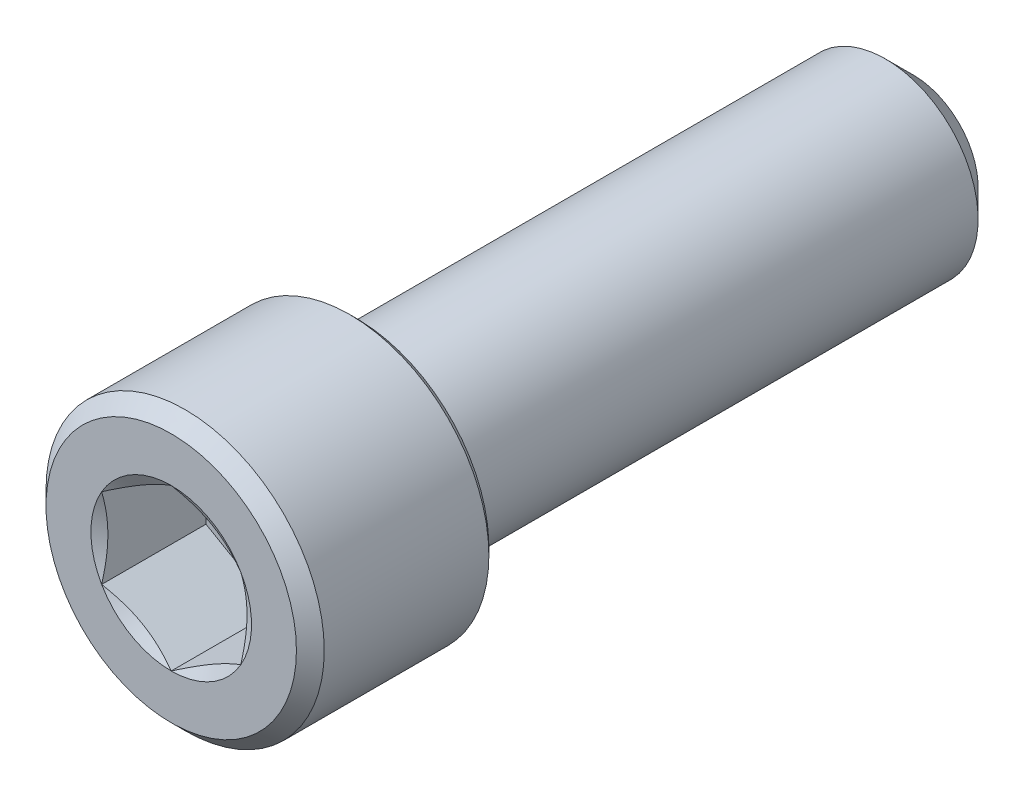
ISO-10303-21;
HEADER;
FILE_DESCRIPTION(('STEP AP214'),'2;1');
FILE_NAME('part.step','',(''),(''),'','','');
FILE_SCHEMA(('AUTOMOTIVE_DESIGN { 1 0 10303 214 1 1 1 1 }'));
ENDSEC;
DATA;
#1=APPLICATION_CONTEXT('core data for automotive mechanical design processes');
#2=APPLICATION_PROTOCOL_DEFINITION('international standard','automotive_design',2000,#1);
#3=PRODUCT_CONTEXT('',#1,'mechanical');
#4=PRODUCT('Part','Part','',(#3));
#5=PRODUCT_RELATED_PRODUCT_CATEGORY('part','',(#4));
#6=PRODUCT_DEFINITION_FORMATION('','',#4);
#7=PRODUCT_DEFINITION_CONTEXT('part definition',#1,'design');
#8=PRODUCT_DEFINITION('design','',#6,#7);
#9=PRODUCT_DEFINITION_SHAPE('','',#8);
#10=(LENGTH_UNIT() NAMED_UNIT(*) SI_UNIT(.MILLI.,.METRE.));
#11=(NAMED_UNIT(*) PLANE_ANGLE_UNIT() SI_UNIT($,.RADIAN.));
#12=(NAMED_UNIT(*) SI_UNIT($,.STERADIAN.) SOLID_ANGLE_UNIT());
#13=UNCERTAINTY_MEASURE_WITH_UNIT(LENGTH_MEASURE(1.E-05),#10,'distance_accuracy_value','');
#14=(GEOMETRIC_REPRESENTATION_CONTEXT(3) GLOBAL_UNCERTAINTY_ASSIGNED_CONTEXT((#13)) GLOBAL_UNIT_ASSIGNED_CONTEXT((#10,
#11,#12)) REPRESENTATION_CONTEXT('',''));
#15=CARTESIAN_POINT('',(0.,0.,0.));
#16=DIRECTION('',(0.,0.,1.));
#17=DIRECTION('',(1.,0.,0.));
#18=AXIS2_PLACEMENT_3D('',#15,#16,#17);
#19=CARTESIAN_POINT('',(0.,4.7625,12.7));
#20=DIRECTION('',(0.,0.,1.));
#21=DIRECTION('',(1.,0.,0.));
#22=AXIS2_PLACEMENT_3D('',#19,#20,#21);
#23=PLANE('',#22);
#24=CARTESIAN_POINT('',(0.,0.,12.7));
#25=DIRECTION('',(0.,0.,1.));
#26=DIRECTION('',(1.,0.,0.));
#27=AXIS2_PLACEMENT_3D('',#24,#25,#26);
#28=CIRCLE('',#27,4.28625);
#29=CARTESIAN_POINT('',(4.28625,0.,12.7));
#30=VERTEX_POINT('',#29);
#31=EDGE_CURVE('E169',#30,#30,#28,.T.);
#32=ORIENTED_EDGE('',*,*,#31,.T.);
#33=EDGE_LOOP('',(#32));
#34=FACE_BOUND('',#33,.T.);
#35=CARTESIAN_POINT('',(0.,0.,12.7));
#36=DIRECTION('',(0.,0.,1.));
#37=DIRECTION('',(1.,0.,0.));
#38=AXIS2_PLACEMENT_3D('',#35,#36,#37);
#39=CIRCLE('',#38,2.74963065701559);
#40=CARTESIAN_POINT('',(2.38125,1.3748153285078,12.7));
#41=VERTEX_POINT('',#40);
#42=CARTESIAN_POINT('',(0.,2.74963065701559,12.7));
#43=VERTEX_POINT('',#42);
#44=EDGE_CURVE('E87',#41,#43,#39,.T.);
#45=ORIENTED_EDGE('',*,*,#44,.F.);
#46=CARTESIAN_POINT('',(2.38125,-1.3748153285078,12.7));
#47=VERTEX_POINT('',#46);
#48=EDGE_CURVE('E47',#47,#41,#39,.T.);
#49=ORIENTED_EDGE('',*,*,#48,.F.);
#50=CARTESIAN_POINT('',(0.,-2.7496306570156,12.7));
#51=VERTEX_POINT('',#50);
#52=EDGE_CURVE('E274',#51,#47,#39,.T.);
#53=ORIENTED_EDGE('',*,*,#52,.F.);
#54=CARTESIAN_POINT('',(-2.38125,-1.3748153285078,12.7));
#55=VERTEX_POINT('',#54);
#56=EDGE_CURVE('E54',#55,#51,#39,.T.);
#57=ORIENTED_EDGE('',*,*,#56,.F.);
#58=CARTESIAN_POINT('',(-2.38125,1.3748153285078,12.7));
#59=VERTEX_POINT('',#58);
#60=EDGE_CURVE('E127',#59,#55,#39,.T.);
#61=ORIENTED_EDGE('',*,*,#60,.F.);
#62=EDGE_CURVE('E96',#43,#59,#39,.T.);
#63=ORIENTED_EDGE('',*,*,#62,.F.);
#64=EDGE_LOOP('',(#45,#49,#53,#57,#61,#63));
#65=FACE_BOUND('',#64,.T.);
#66=ADVANCED_FACE('F33',(#34,#65),#23,.T.);
#67=CARTESIAN_POINT('',(0.,0.,-12.7));
#68=DIRECTION('',(0.,0.,-1.));
#69=DIRECTION('',(-1.,0.,0.));
#70=AXIS2_PLACEMENT_3D('',#67,#68,#69);
#71=CYLINDRICAL_SURFACE('',#70,4.7625);
#72=CARTESIAN_POINT('',(0.,0.,6.58812499999999));
#73=DIRECTION('',(0.,0.,-1.));
#74=DIRECTION('',(-1.,0.,0.));
#75=AXIS2_PLACEMENT_3D('',#72,#73,#74);
#76=CIRCLE('',#75,4.7625);
#77=CARTESIAN_POINT('',(-4.7625,0.,6.58812499999999));
#78=VERTEX_POINT('',#77);
#79=EDGE_CURVE('E11',#78,#78,#76,.F.);
#80=ORIENTED_EDGE('',*,*,#79,.T.);
#81=EDGE_LOOP('',(#80));
#82=FACE_BOUND('',#81,.T.);
#83=CARTESIAN_POINT('',(0.,0.,12.22375));
#84=DIRECTION('',(0.,0.,1.));
#85=DIRECTION('',(1.,0.,0.));
#86=AXIS2_PLACEMENT_3D('',#83,#84,#85);
#87=CIRCLE('',#86,4.7625);
#88=CARTESIAN_POINT('',(4.7625,0.,12.22375));
#89=VERTEX_POINT('',#88);
#90=EDGE_CURVE('E106',#89,#89,#87,.F.);
#91=ORIENTED_EDGE('',*,*,#90,.T.);
#92=EDGE_LOOP('',(#91));
#93=FACE_BOUND('',#92,.T.);
#94=ADVANCED_FACE('F186',(#82,#93),#71,.T.);
#95=CARTESIAN_POINT('',(0.,4.7625,6.35));
#96=DIRECTION('',(0.,0.,-1.));
#97=DIRECTION('',(-1.,0.,0.));
#98=AXIS2_PLACEMENT_3D('',#95,#96,#97);
#99=PLANE('',#98);
#100=CARTESIAN_POINT('',(0.,0.,6.35));
#101=DIRECTION('',(0.,0.,-1.));
#102=DIRECTION('',(-1.,0.,0.));
#103=AXIS2_PLACEMENT_3D('',#100,#101,#102);
#104=CIRCLE('',#103,4.52437500000001);
#105=CARTESIAN_POINT('',(-4.52437500000001,0.,6.35));
#106=VERTEX_POINT('',#105);
#107=EDGE_CURVE('E41',#106,#106,#104,.T.);
#108=ORIENTED_EDGE('',*,*,#107,.T.);
#109=EDGE_LOOP('',(#108));
#110=FACE_BOUND('',#109,.T.);
#111=CARTESIAN_POINT('',(0.,0.,6.35));
#112=DIRECTION('',(0.,0.,-1.));
#113=DIRECTION('',(-1.,0.,0.));
#114=AXIS2_PLACEMENT_3D('',#111,#112,#113);
#115=CIRCLE('',#114,3.175);
#116=CARTESIAN_POINT('',(-3.175,0.,6.35));
#117=VERTEX_POINT('',#116);
#118=EDGE_CURVE('E107',#117,#117,#115,.T.);
#119=ORIENTED_EDGE('',*,*,#118,.F.);
#120=EDGE_LOOP('',(#119));
#121=FACE_BOUND('',#120,.T.);
#122=ADVANCED_FACE('F174',(#110,#121),#99,.T.);
#123=CARTESIAN_POINT('',(0.,0.,-12.7));
#124=DIRECTION('',(0.,0.,-1.));
#125=DIRECTION('',(-1.,0.,0.));
#126=AXIS2_PLACEMENT_3D('',#123,#124,#125);
#127=CYLINDRICAL_SURFACE('',#126,3.175);
#128=ORIENTED_EDGE('',*,*,#118,.T.);
#129=EDGE_LOOP('',(#128));
#130=FACE_BOUND('',#129,.T.);
#131=CARTESIAN_POINT('',(0.,0.,-11.7475));
#132=DIRECTION('',(0.,0.,-1.));
#133=DIRECTION('',(-1.,0.,0.));
#134=AXIS2_PLACEMENT_3D('',#131,#132,#133);
#135=CIRCLE('',#134,3.175);
#136=CARTESIAN_POINT('',(-3.175,0.,-11.7475));
#137=VERTEX_POINT('',#136);
#138=EDGE_CURVE('E215',#137,#137,#135,.T.);
#139=ORIENTED_EDGE('',*,*,#138,.F.);
#140=EDGE_LOOP('',(#139));
#141=FACE_BOUND('',#140,.T.);
#142=ADVANCED_FACE('F197',(#130,#141),#127,.T.);
#143=CARTESIAN_POINT('',(0.,0.,-12.7));
#144=DIRECTION('',(0.,0.,1.));
#145=DIRECTION('',(1.,0.,0.));
#146=AXIS2_PLACEMENT_3D('',#143,#144,#145);
#147=CONICAL_SURFACE('',#146,2.2225,0.785398163397441);
#148=ORIENTED_EDGE('',*,*,#138,.T.);
#149=EDGE_LOOP('',(#148));
#150=FACE_BOUND('',#149,.T.);
#151=CARTESIAN_POINT('',(0.,0.,-12.7));
#152=DIRECTION('',(0.,0.,-1.));
#153=DIRECTION('',(-1.,0.,0.));
#154=AXIS2_PLACEMENT_3D('',#151,#152,#153);
#155=CIRCLE('',#154,2.2225);
#156=CARTESIAN_POINT('',(-2.2225,0.,-12.7));
#157=VERTEX_POINT('',#156);
#158=EDGE_CURVE('E213',#157,#157,#155,.T.);
#159=ORIENTED_EDGE('',*,*,#158,.F.);
#160=EDGE_LOOP('',(#159));
#161=FACE_BOUND('',#160,.T.);
#162=ADVANCED_FACE('F200',(#150,#161),#147,.T.);
#163=CARTESIAN_POINT('',(0.,2.2225,-12.7));
#164=DIRECTION('',(0.,0.,-1.));
#165=DIRECTION('',(-1.,0.,0.));
#166=AXIS2_PLACEMENT_3D('',#163,#164,#165);
#167=PLANE('',#166);
#168=ORIENTED_EDGE('',*,*,#158,.T.);
#169=EDGE_LOOP('',(#168));
#170=FACE_BOUND('',#169,.T.);
#171=ADVANCED_FACE('F203',(#170),#167,.T.);
#172=CARTESIAN_POINT('',(0.,0.,12.7));
#173=DIRECTION('',(0.,0.,1.));
#174=DIRECTION('',(1.,0.,0.));
#175=AXIS2_PLACEMENT_3D('',#172,#173,#174);
#176=CONICAL_SURFACE('',#175,2.74963065701559,1.0471975511966);
#177=ORIENTED_EDGE('',*,*,#62,.T.);
#178=CARTESIAN_POINT('',(0.000199999999999313,2.74974612706943,12.700066670866));
#179=CARTESIAN_POINT('',(-0.104444891421977,2.68932937083763,12.6651705786252));
#180=CARTESIAN_POINT('',(-0.209993068604497,2.62839110232883,12.6334335727749));
#181=CARTESIAN_POINT('',(-0.422917194172112,2.5054593011154,12.5780356628231));
#182=CARTESIAN_POINT('',(-0.53029692661342,2.4434635836849,12.5543943575836));
#183=CARTESIAN_POINT('',(-0.743725586936215,2.32024048919476,12.5175923353969));
#184=CARTESIAN_POINT('',(-0.849741671537568,2.25903207421173,12.504186696564));
#185=CARTESIAN_POINT('',(-1.06227281790212,2.13632715964698,12.4881816145045));
#186=CARTESIAN_POINT('',(-1.16878710689782,2.07483110622277,12.4855689193147));
#187=CARTESIAN_POINT('',(-1.36782399030973,1.95991710800624,12.4909970804572));
#188=CARTESIAN_POINT('',(-1.46037634256186,1.90648198251934,12.4977051369489));
#189=CARTESIAN_POINT('',(-1.64487805384685,1.79995986984301,12.518967960713));
#190=CARTESIAN_POINT('',(-1.73682677447075,1.74687325123916,12.5335299951235));
#191=CARTESIAN_POINT('',(-1.92170905711006,1.64013141558896,12.5699348288166));
#192=CARTESIAN_POINT('',(-2.01461921296538,1.58648971209544,12.5919319849727));
#193=CARTESIAN_POINT('',(-2.19905359425544,1.4800064724098,12.6418572147018));
#194=CARTESIAN_POINT('',(-2.29058018354621,1.42716357144477,12.6697735535082));
#195=CARTESIAN_POINT('',(-2.38145,1.37469985845396,12.700066670866));
#196=B_SPLINE_CURVE_WITH_KNOTS('',3,(#178,#179,#180,#181,#182,#183,#184,#185,#186,#187,#188,
#189,#190,#191,#192,#193,#194,#195),.UNSPECIFIED.,.F.,.F.,(4,2,2,2,2,2,2,2,4),(0.,
0.377463001720441,0.755833447356087,1.1248388545394,1.49339104874267,1.81432726847354,
2.1355609551887,2.46392121913821,2.79163649648301),.UNSPECIFIED.);
#197=EDGE_CURVE('E101',#43,#59,#196,.T.);
#198=ORIENTED_EDGE('',*,*,#197,.F.);
#199=EDGE_LOOP('',(#177,#198));
#200=FACE_BOUND('',#199,.T.);
#201=ADVANCED_FACE('F102',(#200),#176,.F.);
#202=ORIENTED_EDGE('',*,*,#60,.T.);
#203=CARTESIAN_POINT('',(-2.38125,-3.56031432041408,13.5854327813108));
#204=CARTESIAN_POINT('',(-2.38125,-3.45748374459471,13.5360985621719));
#205=CARTESIAN_POINT('',(-2.38125,-3.35440265943941,13.4872767676642));
#206=CARTESIAN_POINT('',(-2.38125,-3.14760595557445,13.3909487177979));
#207=CARTESIAN_POINT('',(-2.38125,-3.04389022671774,13.3434426991917));
#208=CARTESIAN_POINT('',(-2.38125,-2.83509604479696,13.2497714977183));
#209=CARTESIAN_POINT('',(-2.38125,-2.73001314180502,13.2036161964771));
#210=CARTESIAN_POINT('',(-2.38125,-2.5189655488985,13.1133753131819));
#211=CARTESIAN_POINT('',(-2.38125,-2.41300090517103,13.0692896235117));
#212=CARTESIAN_POINT('',(-2.38125,-2.19722997657368,12.9826164755131));
#213=CARTESIAN_POINT('',(-2.38125,-2.08739568642801,12.9400983262348));
#214=CARTESIAN_POINT('',(-2.38125,-1.86639857650948,12.8585970218555));
#215=CARTESIAN_POINT('',(-2.38125,-1.75523560433475,12.8196142767613));
#216=CARTESIAN_POINT('',(-2.38125,-1.53166103833463,12.7462985594297));
#217=CARTESIAN_POINT('',(-2.38125,-1.41925300915091,12.7119548339663));
#218=CARTESIAN_POINT('',(-2.38125,-1.19282596671567,12.6490916591874));
#219=CARTESIAN_POINT('',(-2.38125,-1.07880736110514,12.620570763371));
#220=CARTESIAN_POINT('',(-2.38125,-0.849396676134234,12.5708736258817));
#221=CARTESIAN_POINT('',(-2.38125,-0.734007929376447,12.54968229925));
#222=CARTESIAN_POINT('',(-2.38125,-0.501939482389592,12.5160319446491));
#223=CARTESIAN_POINT('',(-2.38125,-0.385259869941057,12.503572326575));
#224=CARTESIAN_POINT('',(-2.38125,-0.152653744375681,12.4885413975669));
#225=CARTESIAN_POINT('',(-2.38125,-0.036734958225554,12.4858533979373));
#226=CARTESIAN_POINT('',(-2.38125,0.194921420761422,12.4902935875384));
#227=CARTESIAN_POINT('',(-2.38125,0.310659001934529,12.4974223845882));
#228=CARTESIAN_POINT('',(-2.38125,0.511064358227531,12.5177854394961));
#229=CARTESIAN_POINT('',(-2.38125,0.595953717526414,12.5289393879405));
#230=CARTESIAN_POINT('',(-2.38125,0.765022556422734,12.555761218176));
#231=CARTESIAN_POINT('',(-2.38125,0.849201910592195,12.5714298810206));
#232=CARTESIAN_POINT('',(-2.38125,1.10063158151713,12.6243792501024));
#233=CARTESIAN_POINT('',(-2.38125,1.26664254896707,12.6675883896334));
#234=CARTESIAN_POINT('',(-2.38125,1.51487878922651,12.7414090899076));
#235=CARTESIAN_POINT('',(-2.38125,1.59841261020007,12.7678615121722));
#236=CARTESIAN_POINT('',(-2.38125,1.76461552147617,12.8232125840672));
#237=CARTESIAN_POINT('',(-2.38125,1.8472851157426,12.8521097070595));
#238=CARTESIAN_POINT('',(-2.38125,2.0118638893944,12.9119314662197));
#239=CARTESIAN_POINT('',(-2.38125,2.09377320390112,12.9428557339181));
#240=CARTESIAN_POINT('',(-2.38125,2.25694684606751,13.0063968176601));
#241=CARTESIAN_POINT('',(-2.38125,2.33821106206296,13.0390139196664));
#242=CARTESIAN_POINT('',(-2.38125,2.54564055797725,13.1243605981753));
#243=CARTESIAN_POINT('',(-2.38125,2.67139077643561,13.1780976536597));
#244=CARTESIAN_POINT('',(-2.38125,2.92175828712318,13.2881569837741));
#245=CARTESIAN_POINT('',(-2.38125,3.04637549364049,13.3444794520717));
#246=CARTESIAN_POINT('',(-2.38125,3.29471124185556,13.459122490172));
#247=CARTESIAN_POINT('',(-2.38125,3.41842962310426,13.517443406587));
#248=CARTESIAN_POINT('',(-2.38125,3.66512129458494,13.6356427619708));
#249=CARTESIAN_POINT('',(-2.38125,3.78809456817208,13.6955212355767));
#250=CARTESIAN_POINT('',(-2.38125,4.15640373223128,13.8771342351465));
#251=CARTESIAN_POINT('',(-2.38125,4.40083218751396,14.0007072817698));
#252=CARTESIAN_POINT('',(-2.38125,4.8880155134677,14.251013712694));
#253=CARTESIAN_POINT('',(-2.38125,5.13077059191436,14.3777466952773));
#254=CARTESIAN_POINT('',(-2.38125,5.59226335071453,14.6213405276704));
#255=CARTESIAN_POINT('',(-2.38125,5.81110530618685,14.7380041437275));
#256=CARTESIAN_POINT('',(-2.38125,6.24808533417811,14.9726596021958));
#257=CARTESIAN_POINT('',(-2.38125,6.46622338026151,15.0906514937607));
#258=CARTESIAN_POINT('',(-2.38125,6.90140294653572,15.3273300538684));
#259=CARTESIAN_POINT('',(-2.38125,7.11844584451928,15.4460141918825));
#260=CARTESIAN_POINT('',(-2.38125,7.55209283139575,15.6841549301874));
#261=CARTESIAN_POINT('',(-2.38125,7.7686969426581,15.8036114897285));
#262=CARTESIAN_POINT('',(-2.38125,7.98514341619629,15.9233511700018));
#263=B_SPLINE_CURVE_WITH_KNOTS('',3,(#203,#204,#205,#206,#207,#208,#209,#210,#211,#212,#213,
#214,#215,#216,#217,#218,#219,#220,#221,#222,#223,#224,#225,#226,#227,#228,#229,#230,#231,#232,
#233,#234,#235,#236,#237,#238,#239,#240,#241,#242,#243,#244,#245,#246,#247,#248,#249,#250,#251,
#252,#253,#254,#255,#256,#257,#258,#259,#260,#261,#262),.UNSPECIFIED.,.F.,.F.,(4,2,2,2,2,2,2,2,
2,2,2,2,2,2,2,2,2,2,2,2,2,2,2,2,2,2,2,2,2,4),(0.,0.342162623348211,0.684386418445571,
1.02868615523156,1.37296796912697,1.72625126026709,2.07957547001313,2.43206608144725,
2.78446902072291,3.13614230382947,3.48779181791892,3.83522802132629,4.18268573764542,
4.43941585883896,4.69619042147775,5.21013322351853,5.47298093255488,5.73566569629106,
5.99830284411161,6.26098450333651,6.67119502065647,7.08143631626132,7.49174912817907,
7.90207107246849,8.72369797816941,9.54522095899754,10.2892038704941,11.0332144046983,
11.7753325322694,12.5174118231823),.UNSPECIFIED.);
#264=EDGE_CURVE('E95',#59,#55,#263,.F.);
#265=ORIENTED_EDGE('',*,*,#264,.F.);
#266=EDGE_LOOP('',(#202,#265));
#267=FACE_BOUND('',#266,.T.);
#268=ADVANCED_FACE('F210',(#267),#176,.F.);
#269=ORIENTED_EDGE('',*,*,#56,.T.);
#270=CARTESIAN_POINT('',(-2.38145,-1.37469985845396,12.700066670866));
#271=CARTESIAN_POINT('',(-2.27680510857802,-1.43511661468576,12.6651705786252));
#272=CARTESIAN_POINT('',(-2.1712569313955,-1.49605488319456,12.6334335727749));
#273=CARTESIAN_POINT('',(-1.95833280582789,-1.61898668440799,12.5780356628231));
#274=CARTESIAN_POINT('',(-1.85095307338658,-1.68098240183849,12.5543943575836));
#275=CARTESIAN_POINT('',(-1.63752441306379,-1.80420549632863,12.5175923353969));
#276=CARTESIAN_POINT('',(-1.53150832846243,-1.86541391131165,12.504186696564));
#277=CARTESIAN_POINT('',(-1.31897718209788,-1.98811882587641,12.4881816145045));
#278=CARTESIAN_POINT('',(-1.21246289310218,-2.04961487930061,12.4855689193147));
#279=CARTESIAN_POINT('',(-1.01342600969028,-2.16452887751714,12.4909970804572));
#280=CARTESIAN_POINT('',(-0.920873657438137,-2.21796400300405,12.4977051369489));
#281=CARTESIAN_POINT('',(-0.736371946153154,-2.32448611568038,12.518967960713));
#282=CARTESIAN_POINT('',(-0.644423225529254,-2.37757273428423,12.5335299951235));
#283=CARTESIAN_POINT('',(-0.459540942889936,-2.48431456993443,12.5699348288166));
#284=CARTESIAN_POINT('',(-0.366630787034621,-2.53795627342795,12.5919319849727));
#285=CARTESIAN_POINT('',(-0.182196405744562,-2.64443951311359,12.6418572147018));
#286=CARTESIAN_POINT('',(-0.0906698164537942,-2.69728241407862,12.6697735535082));
#287=CARTESIAN_POINT('',(0.000200000000000922,-2.74974612706943,12.700066670866));
#288=B_SPLINE_CURVE_WITH_KNOTS('',3,(#270,#271,#272,#273,#274,#275,#276,#277,#278,#279,#280,
#281,#282,#283,#284,#285,#286,#287),.UNSPECIFIED.,.F.,.F.,(4,2,2,2,2,2,2,2,4),(0.,
0.377463001720441,0.755833447356087,1.1248388545394,1.49339104874266,1.81432726847354,
2.1355609551887,2.46392121913821,2.79163649648301),.UNSPECIFIED.);
#289=EDGE_CURVE('E137',#55,#51,#288,.T.);
#290=ORIENTED_EDGE('',*,*,#289,.F.);
#291=EDGE_LOOP('',(#269,#290));
#292=FACE_BOUND('',#291,.T.);
#293=ADVANCED_FACE('F277',(#292),#176,.F.);
#294=ORIENTED_EDGE('',*,*,#52,.T.);
#295=CARTESIAN_POINT('',(-0.000199999999998967,-2.74974612706943,12.700066670866));
#296=CARTESIAN_POINT('',(0.104444891421977,-2.68932937083763,12.6651705786252));
#297=CARTESIAN_POINT('',(0.209993068604497,-2.62839110232883,12.6334335727749));
#298=CARTESIAN_POINT('',(0.422917194172112,-2.5054593011154,12.5780356628231));
#299=CARTESIAN_POINT('',(0.53029692661342,-2.4434635836849,12.5543943575836));
#300=CARTESIAN_POINT('',(0.743725586936215,-2.32024048919476,12.5175923353969));
#301=CARTESIAN_POINT('',(0.849741671537568,-2.25903207421174,12.504186696564));
#302=CARTESIAN_POINT('',(1.06227281790212,-2.13632715964698,12.4881816145045));
#303=CARTESIAN_POINT('',(1.16878710689782,-2.07483110622277,12.4855689193147));
#304=CARTESIAN_POINT('',(1.36782399030972,-1.95991710800625,12.4909970804572));
#305=CARTESIAN_POINT('',(1.46037634256186,-1.90648198251934,12.4977051369489));
#306=CARTESIAN_POINT('',(1.64487805384684,-1.79995986984301,12.518967960713));
#307=CARTESIAN_POINT('',(1.73682677447075,-1.74687325123916,12.5335299951235));
#308=CARTESIAN_POINT('',(1.92170905711006,-1.64013141558896,12.5699348288166));
#309=CARTESIAN_POINT('',(2.01461921296538,-1.58648971209544,12.5919319849727));
#310=CARTESIAN_POINT('',(2.19905359425544,-1.4800064724098,12.6418572147018));
#311=CARTESIAN_POINT('',(2.29058018354621,-1.42716357144477,12.6697735535082));
#312=CARTESIAN_POINT('',(2.38145,-1.37469985845396,12.700066670866));
#313=B_SPLINE_CURVE_WITH_KNOTS('',3,(#295,#296,#297,#298,#299,#300,#301,#302,#303,#304,#305,
#306,#307,#308,#309,#310,#311,#312),.UNSPECIFIED.,.F.,.F.,(4,2,2,2,2,2,2,2,4),(0.,
0.377463001720441,0.755833447356087,1.1248388545394,1.49339104874266,1.81432726847353,
2.1355609551887,2.4639212191382,2.79163649648301),.UNSPECIFIED.);
#314=EDGE_CURVE('E251',#51,#47,#313,.T.);
#315=ORIENTED_EDGE('',*,*,#314,.F.);
#316=EDGE_LOOP('',(#294,#315));
#317=FACE_BOUND('',#316,.T.);
#318=ADVANCED_FACE('F276',(#317),#176,.F.);
#319=ORIENTED_EDGE('',*,*,#48,.T.);
#320=CARTESIAN_POINT('',(2.38125,-3.56031432041408,13.5854327813108));
#321=CARTESIAN_POINT('',(2.38125,-3.45748374459471,13.5360985621719));
#322=CARTESIAN_POINT('',(2.38125,-3.35440265943941,13.4872767676642));
#323=CARTESIAN_POINT('',(2.38125,-3.14760595557445,13.390948717798));
#324=CARTESIAN_POINT('',(2.38125,-3.04389022671774,13.3434426991917));
#325=CARTESIAN_POINT('',(2.38125,-2.83509604479696,13.2497714977183));
#326=CARTESIAN_POINT('',(2.38125,-2.73001314180502,13.2036161964771));
#327=CARTESIAN_POINT('',(2.38125,-2.5189655488985,13.1133753131819));
#328=CARTESIAN_POINT('',(2.38125,-2.41300090517103,13.0692896235117));
#329=CARTESIAN_POINT('',(2.38125,-2.19722997657368,12.9826164755131));
#330=CARTESIAN_POINT('',(2.38125,-2.08739568642801,12.9400983262348));
#331=CARTESIAN_POINT('',(2.38125,-1.86639857650948,12.8585970218555));
#332=CARTESIAN_POINT('',(2.38125,-1.75523560433474,12.8196142767613));
#333=CARTESIAN_POINT('',(2.38125,-1.53166103833463,12.7462985594297));
#334=CARTESIAN_POINT('',(2.38125,-1.41925300915091,12.7119548339663));
#335=CARTESIAN_POINT('',(2.38125,-1.19282596671567,12.6490916591874));
#336=CARTESIAN_POINT('',(2.38125,-1.07880736110514,12.620570763371));
#337=CARTESIAN_POINT('',(2.38125,-0.849396676134233,12.5708736258817));
#338=CARTESIAN_POINT('',(2.38125,-0.734007929376446,12.54968229925));
#339=CARTESIAN_POINT('',(2.38125,-0.501939482389591,12.5160319446491));
#340=CARTESIAN_POINT('',(2.38125,-0.385259869941056,12.503572326575));
#341=CARTESIAN_POINT('',(2.38125,-0.152653744375681,12.4885413975669));
#342=CARTESIAN_POINT('',(2.38125,-0.0367349582255534,12.4858533979373));
#343=CARTESIAN_POINT('',(2.38125,0.194921420761423,12.4902935875384));
#344=CARTESIAN_POINT('',(2.38125,0.31065900193453,12.4974223845882));
#345=CARTESIAN_POINT('',(2.38125,0.511064358227531,12.5177854394961));
#346=CARTESIAN_POINT('',(2.38125,0.595953717526415,12.5289393879405));
#347=CARTESIAN_POINT('',(2.38125,0.765022556422735,12.555761218176));
#348=CARTESIAN_POINT('',(2.38125,0.849201910592195,12.5714298810206));
#349=CARTESIAN_POINT('',(2.38125,1.10063158151713,12.6243792501024));
#350=CARTESIAN_POINT('',(2.38125,1.26664254896707,12.6675883896334));
#351=CARTESIAN_POINT('',(2.38125,1.51487878922651,12.7414090899076));
#352=CARTESIAN_POINT('',(2.38125,1.59841261020007,12.7678615121722));
#353=CARTESIAN_POINT('',(2.38125,1.76461552147617,12.8232125840672));
#354=CARTESIAN_POINT('',(2.38125,1.8472851157426,12.8521097070595));
#355=CARTESIAN_POINT('',(2.38125,2.0118638893944,12.9119314662197));
#356=CARTESIAN_POINT('',(2.38125,2.09377320390112,12.9428557339181));
#357=CARTESIAN_POINT('',(2.38125,2.25694684606751,13.0063968176601));
#358=CARTESIAN_POINT('',(2.38125,2.33821106206296,13.0390139196664));
#359=CARTESIAN_POINT('',(2.38125,2.54564055797725,13.1243605981753));
#360=CARTESIAN_POINT('',(2.38125,2.67139077643561,13.1780976536597));
#361=CARTESIAN_POINT('',(2.38125,2.92175828712318,13.2881569837741));
#362=CARTESIAN_POINT('',(2.38125,3.04637549364049,13.3444794520717));
#363=CARTESIAN_POINT('',(2.38125,3.29471124185556,13.459122490172));
#364=CARTESIAN_POINT('',(2.38125,3.41842962310426,13.5174434065869));
#365=CARTESIAN_POINT('',(2.38125,3.66512129458494,13.6356427619708));
#366=CARTESIAN_POINT('',(2.38125,3.78809456817208,13.6955212355767));
#367=CARTESIAN_POINT('',(2.38125,4.15640373223128,13.8771342351465));
#368=CARTESIAN_POINT('',(2.38125,4.40083218751396,14.0007072817698));
#369=CARTESIAN_POINT('',(2.38125,4.88801551346769,14.251013712694));
#370=CARTESIAN_POINT('',(2.38125,5.13077059191436,14.3777466952773));
#371=CARTESIAN_POINT('',(2.38125,5.59226335071453,14.6213405276704));
#372=CARTESIAN_POINT('',(2.38125,5.81110530618685,14.7380041437275));
#373=CARTESIAN_POINT('',(2.38125,6.24808533417811,14.9726596021958));
#374=CARTESIAN_POINT('',(2.38125,6.46622338026151,15.0906514937607));
#375=CARTESIAN_POINT('',(2.38125,6.90140294653572,15.3273300538684));
#376=CARTESIAN_POINT('',(2.38125,7.11844584451928,15.4460141918825));
#377=CARTESIAN_POINT('',(2.38125,7.55209283139575,15.6841549301874));
#378=CARTESIAN_POINT('',(2.38125,7.7686969426581,15.8036114897285));
#379=CARTESIAN_POINT('',(2.38125,7.98514341619629,15.9233511700018));
#380=B_SPLINE_CURVE_WITH_KNOTS('',3,(#320,#321,#322,#323,#324,#325,#326,#327,#328,#329,#330,
#331,#332,#333,#334,#335,#336,#337,#338,#339,#340,#341,#342,#343,#344,#345,#346,#347,#348,#349,
#350,#351,#352,#353,#354,#355,#356,#357,#358,#359,#360,#361,#362,#363,#364,#365,#366,#367,#368,
#369,#370,#371,#372,#373,#374,#375,#376,#377,#378,#379),.UNSPECIFIED.,.F.,.F.,(4,2,2,2,2,2,2,2,
2,2,2,2,2,2,2,2,2,2,2,2,2,2,2,2,2,2,2,2,2,4),(0.,0.34216262334821,0.684386418445569,
1.02868615523156,1.37296796912697,1.72625126026709,2.07957547001313,2.43206608144725,
2.78446902072291,3.13614230382947,3.48779181791892,3.83522802132629,4.18268573764542,
4.43941585883896,4.69619042147775,5.21013322351853,5.47298093255488,5.73566569629106,
5.99830284411161,6.26098450333651,6.67119502065648,7.08143631626132,7.49174912817907,
7.90207107246849,8.72369797816941,9.54522095899753,10.2892038704941,11.0332144046983,
11.7753325322695,12.5174118231823),.UNSPECIFIED.);
#381=EDGE_CURVE('E117',#47,#41,#380,.T.);
#382=ORIENTED_EDGE('',*,*,#381,.F.);
#383=EDGE_LOOP('',(#319,#382));
#384=FACE_BOUND('',#383,.T.);
#385=ADVANCED_FACE('F287',(#384),#176,.F.);
#386=ORIENTED_EDGE('',*,*,#44,.T.);
#387=CARTESIAN_POINT('',(2.38145,1.37469985845396,12.700066670866));
#388=CARTESIAN_POINT('',(2.27680510857802,1.43511661468576,12.6651705786252));
#389=CARTESIAN_POINT('',(2.1712569313955,1.49605488319456,12.6334335727749));
#390=CARTESIAN_POINT('',(1.95833280582789,1.61898668440799,12.5780356628231));
#391=CARTESIAN_POINT('',(1.85095307338658,1.68098240183849,12.5543943575836));
#392=CARTESIAN_POINT('',(1.63752441306379,1.80420549632863,12.5175923353969));
#393=CARTESIAN_POINT('',(1.53150832846243,1.86541391131165,12.504186696564));
#394=CARTESIAN_POINT('',(1.31897718209788,1.98811882587641,12.4881816145045));
#395=CARTESIAN_POINT('',(1.21246289310218,2.04961487930062,12.4855689193147));
#396=CARTESIAN_POINT('',(1.01342600969027,2.16452887751714,12.4909970804572));
#397=CARTESIAN_POINT('',(0.920873657438137,2.21796400300405,12.4977051369489));
#398=CARTESIAN_POINT('',(0.736371946153154,2.32448611568038,12.518967960713));
#399=CARTESIAN_POINT('',(0.644423225529254,2.37757273428423,12.5335299951235));
#400=CARTESIAN_POINT('',(0.459540942889937,2.48431456993443,12.5699348288166));
#401=CARTESIAN_POINT('',(0.366630787034622,2.53795627342795,12.5919319849727));
#402=CARTESIAN_POINT('',(0.182196405744562,2.64443951311359,12.6418572147018));
#403=CARTESIAN_POINT('',(0.090669816453795,2.69728241407862,12.6697735535082));
#404=CARTESIAN_POINT('',(-0.000200000000000202,2.74974612706943,12.700066670866));
#405=B_SPLINE_CURVE_WITH_KNOTS('',3,(#387,#388,#389,#390,#391,#392,#393,#394,#395,#396,#397,
#398,#399,#400,#401,#402,#403,#404),.UNSPECIFIED.,.F.,.F.,(4,2,2,2,2,2,2,2,4),(0.,
0.377463001720441,0.755833447356088,1.12483885453941,1.49339104874267,1.81432726847354,
2.1355609551887,2.46392121913821,2.79163649648301),.UNSPECIFIED.);
#406=EDGE_CURVE('E91',#41,#43,#405,.T.);
#407=ORIENTED_EDGE('',*,*,#406,.F.);
#408=EDGE_LOOP('',(#386,#407));
#409=FACE_BOUND('',#408,.T.);
#410=ADVANCED_FACE('F89',(#409),#176,.F.);
#411=CARTESIAN_POINT('',(0.,0.,9.128125));
#412=DIRECTION('',(0.,0.,1.));
#413=DIRECTION('',(1.,0.,0.));
#414=AXIS2_PLACEMENT_3D('',#411,#412,#413);
#415=PLANE('',#414);
#416=DIRECTION('',(-0.866025403784439,0.499999999999999,0.));
#417=VECTOR('',#416,1.);
#418=CARTESIAN_POINT('',(2.38125,1.3748153285078,9.128125));
#419=LINE('',#418,#417);
#420=CARTESIAN_POINT('',(2.38125,1.3748153285078,9.128125));
#421=VERTEX_POINT('',#420);
#422=CARTESIAN_POINT('',(0.,2.74963065701559,9.128125));
#423=VERTEX_POINT('',#422);
#424=EDGE_CURVE('E116',#421,#423,#419,.T.);
#425=ORIENTED_EDGE('',*,*,#424,.T.);
#426=DIRECTION('',(-0.866025403784439,-0.5,0.));
#427=VECTOR('',#426,1.);
#428=CARTESIAN_POINT('',(0.,2.74963065701559,9.128125));
#429=LINE('',#428,#427);
#430=CARTESIAN_POINT('',(-2.38125,1.3748153285078,9.128125));
#431=VERTEX_POINT('',#430);
#432=EDGE_CURVE('E121',#423,#431,#429,.T.);
#433=ORIENTED_EDGE('',*,*,#432,.T.);
#434=DIRECTION('',(0.,-1.,0.));
#435=VECTOR('',#434,1.);
#436=CARTESIAN_POINT('',(-2.38125,1.3748153285078,9.128125));
#437=LINE('',#436,#435);
#438=CARTESIAN_POINT('',(-2.38125,-1.3748153285078,9.128125));
#439=VERTEX_POINT('',#438);
#440=EDGE_CURVE('E237',#431,#439,#437,.T.);
#441=ORIENTED_EDGE('',*,*,#440,.T.);
#442=DIRECTION('',(0.866025403784439,-0.5,0.));
#443=VECTOR('',#442,1.);
#444=CARTESIAN_POINT('',(-2.38125,-1.3748153285078,9.128125));
#445=LINE('',#444,#443);
#446=CARTESIAN_POINT('',(0.,-2.74963065701559,9.128125));
#447=VERTEX_POINT('',#446);
#448=EDGE_CURVE('E234',#439,#447,#445,.T.);
#449=ORIENTED_EDGE('',*,*,#448,.T.);
#450=DIRECTION('',(0.866025403784439,0.5,0.));
#451=VECTOR('',#450,1.);
#452=CARTESIAN_POINT('',(0.,-2.74963065701559,9.128125));
#453=LINE('',#452,#451);
#454=CARTESIAN_POINT('',(2.38125,-1.3748153285078,9.128125));
#455=VERTEX_POINT('',#454);
#456=EDGE_CURVE('E231',#447,#455,#453,.T.);
#457=ORIENTED_EDGE('',*,*,#456,.T.);
#458=DIRECTION('',(0.,1.,0.));
#459=VECTOR('',#458,1.);
#460=CARTESIAN_POINT('',(2.38125,-1.3748153285078,9.128125));
#461=LINE('',#460,#459);
#462=EDGE_CURVE('E124',#455,#421,#461,.T.);
#463=ORIENTED_EDGE('',*,*,#462,.T.);
#464=EDGE_LOOP('',(#425,#433,#441,#449,#457,#463));
#465=FACE_BOUND('',#464,.T.);
#466=ADVANCED_FACE('F157',(#465),#415,.T.);
#467=CARTESIAN_POINT('',(0.,2.74963065701559,9.128125));
#468=DIRECTION('',(-0.5,0.866025403784438,0.));
#469=DIRECTION('',(-0.866025403784439,-0.5,0.));
#470=AXIS2_PLACEMENT_3D('',#467,#468,#469);
#471=PLANE('',#470);
#472=DIRECTION('',(0.,0.,1.));
#473=VECTOR('',#472,1.);
#474=CARTESIAN_POINT('',(0.,2.74963065701559,9.128125));
#475=LINE('',#474,#473);
#476=EDGE_CURVE('E113',#423,#43,#475,.T.);
#477=ORIENTED_EDGE('',*,*,#476,.T.);
#478=ORIENTED_EDGE('',*,*,#197,.T.);
#479=DIRECTION('',(0.,0.,1.));
#480=VECTOR('',#479,1.);
#481=CARTESIAN_POINT('',(-2.38125,1.3748153285078,9.128125));
#482=LINE('',#481,#480);
#483=EDGE_CURVE('E123',#431,#59,#482,.T.);
#484=ORIENTED_EDGE('',*,*,#483,.F.);
#485=ORIENTED_EDGE('',*,*,#432,.F.);
#486=EDGE_LOOP('',(#477,#478,#484,#485));
#487=FACE_BOUND('',#486,.T.);
#488=ADVANCED_FACE('F119',(#487),#471,.F.);
#489=CARTESIAN_POINT('',(-2.38125,1.3748153285078,9.128125));
#490=DIRECTION('',(-1.,0.,0.));
#491=DIRECTION('',(0.,-1.,0.));
#492=AXIS2_PLACEMENT_3D('',#489,#490,#491);
#493=PLANE('',#492);
#494=ORIENTED_EDGE('',*,*,#483,.T.);
#495=ORIENTED_EDGE('',*,*,#264,.T.);
#496=DIRECTION('',(0.,0.,1.));
#497=VECTOR('',#496,1.);
#498=CARTESIAN_POINT('',(-2.38125,-1.3748153285078,9.128125));
#499=LINE('',#498,#497);
#500=EDGE_CURVE('E222',#439,#55,#499,.T.);
#501=ORIENTED_EDGE('',*,*,#500,.F.);
#502=ORIENTED_EDGE('',*,*,#440,.F.);
#503=EDGE_LOOP('',(#494,#495,#501,#502));
#504=FACE_BOUND('',#503,.T.);
#505=ADVANCED_FACE('F146',(#504),#493,.F.);
#506=CARTESIAN_POINT('',(-2.38125,-1.3748153285078,9.128125));
#507=DIRECTION('',(-0.5,-0.866025403784439,0.));
#508=DIRECTION('',(0.866025403784439,-0.5,0.));
#509=AXIS2_PLACEMENT_3D('',#506,#507,#508);
#510=PLANE('',#509);
#511=ORIENTED_EDGE('',*,*,#500,.T.);
#512=ORIENTED_EDGE('',*,*,#289,.T.);
#513=DIRECTION('',(0.,0.,1.));
#514=VECTOR('',#513,1.);
#515=CARTESIAN_POINT('',(0.,-2.74963065701559,9.128125));
#516=LINE('',#515,#514);
#517=EDGE_CURVE('E225',#447,#51,#516,.T.);
#518=ORIENTED_EDGE('',*,*,#517,.F.);
#519=ORIENTED_EDGE('',*,*,#448,.F.);
#520=EDGE_LOOP('',(#511,#512,#518,#519));
#521=FACE_BOUND('',#520,.T.);
#522=ADVANCED_FACE('F150',(#521),#510,.F.);
#523=CARTESIAN_POINT('',(0.,-2.74963065701559,9.128125));
#524=DIRECTION('',(0.5,-0.866025403784438,0.));
#525=DIRECTION('',(0.866025403784439,0.5,0.));
#526=AXIS2_PLACEMENT_3D('',#523,#524,#525);
#527=PLANE('',#526);
#528=ORIENTED_EDGE('',*,*,#517,.T.);
#529=ORIENTED_EDGE('',*,*,#314,.T.);
#530=DIRECTION('',(0.,0.,1.));
#531=VECTOR('',#530,1.);
#532=CARTESIAN_POINT('',(2.38125,-1.3748153285078,9.128125));
#533=LINE('',#532,#531);
#534=EDGE_CURVE('E218',#455,#47,#533,.T.);
#535=ORIENTED_EDGE('',*,*,#534,.F.);
#536=ORIENTED_EDGE('',*,*,#456,.F.);
#537=EDGE_LOOP('',(#528,#529,#535,#536));
#538=FACE_BOUND('',#537,.T.);
#539=ADVANCED_FACE('F259',(#538),#527,.F.);
#540=CARTESIAN_POINT('',(2.38125,-1.3748153285078,9.128125));
#541=DIRECTION('',(1.,0.,0.));
#542=DIRECTION('',(0.,1.,0.));
#543=AXIS2_PLACEMENT_3D('',#540,#541,#542);
#544=PLANE('',#543);
#545=ORIENTED_EDGE('',*,*,#534,.T.);
#546=ORIENTED_EDGE('',*,*,#381,.T.);
#547=DIRECTION('',(0.,0.,1.));
#548=VECTOR('',#547,1.);
#549=CARTESIAN_POINT('',(2.38125,1.3748153285078,9.128125));
#550=LINE('',#549,#548);
#551=EDGE_CURVE('E115',#421,#41,#550,.T.);
#552=ORIENTED_EDGE('',*,*,#551,.F.);
#553=ORIENTED_EDGE('',*,*,#462,.F.);
#554=EDGE_LOOP('',(#545,#546,#552,#553));
#555=FACE_BOUND('',#554,.T.);
#556=ADVANCED_FACE('F256',(#555),#544,.F.);
#557=CARTESIAN_POINT('',(2.38125,1.3748153285078,9.128125));
#558=DIRECTION('',(0.499999999999999,0.866025403784439,0.));
#559=DIRECTION('',(-0.866025403784439,0.499999999999999,0.));
#560=AXIS2_PLACEMENT_3D('',#557,#558,#559);
#561=PLANE('',#560);
#562=ORIENTED_EDGE('',*,*,#551,.T.);
#563=ORIENTED_EDGE('',*,*,#406,.T.);
#564=ORIENTED_EDGE('',*,*,#476,.F.);
#565=ORIENTED_EDGE('',*,*,#424,.F.);
#566=EDGE_LOOP('',(#562,#563,#564,#565));
#567=FACE_BOUND('',#566,.T.);
#568=ADVANCED_FACE('F111',(#567),#561,.F.);
#569=CARTESIAN_POINT('',(0.,0.,12.22375));
#570=DIRECTION('',(0.,0.,-1.));
#571=DIRECTION('',(-1.,0.,0.));
#572=AXIS2_PLACEMENT_3D('',#569,#570,#571);
#573=CONICAL_SURFACE('',#572,4.7625,0.785398163397448);
#574=ORIENTED_EDGE('',*,*,#31,.F.);
#575=EDGE_LOOP('',(#574));
#576=FACE_BOUND('',#575,.T.);
#577=ORIENTED_EDGE('',*,*,#90,.F.);
#578=EDGE_LOOP('',(#577));
#579=FACE_BOUND('',#578,.T.);
#580=ADVANCED_FACE('F178',(#576,#579),#573,.T.);
#581=CARTESIAN_POINT('',(0.,0.,6.35));
#582=DIRECTION('',(0.,0.,1.));
#583=DIRECTION('',(1.,0.,0.));
#584=AXIS2_PLACEMENT_3D('',#581,#582,#583);
#585=CONICAL_SURFACE('',#584,4.52437500000001,0.785398163397448);
#586=ORIENTED_EDGE('',*,*,#79,.F.);
#587=EDGE_LOOP('',(#586));
#588=FACE_BOUND('',#587,.T.);
#589=ORIENTED_EDGE('',*,*,#107,.F.);
#590=EDGE_LOOP('',(#589));
#591=FACE_BOUND('',#590,.T.);
#592=ADVANCED_FACE('F35',(#588,#591),#585,.T.);
#593=CLOSED_SHELL('',(#66,#94,#122,#142,#162,#171,#201,#268,#293,#318,#385,#410,#466,#488,#505,
#522,#539,#556,#568,#580,#592));
#594=MANIFOLD_SOLID_BREP('B2',#593);
#595=ADVANCED_BREP_SHAPE_REPRESENTATION('',(#18,#594),#14);
#596=SHAPE_DEFINITION_REPRESENTATION(#9,#595);
ENDSEC;
END-ISO-10303-21;
